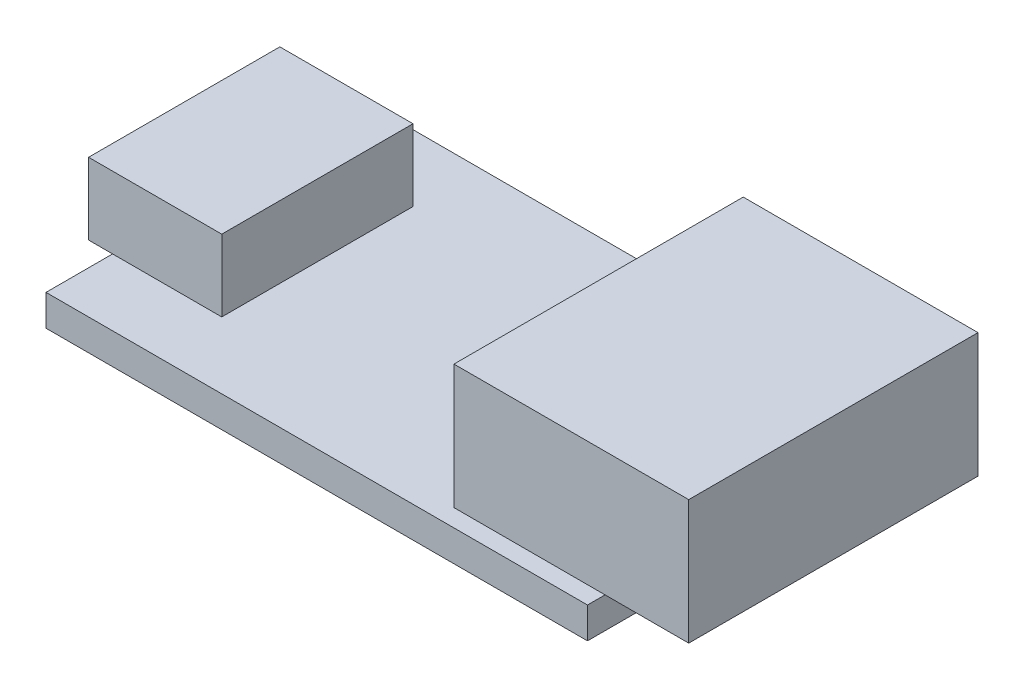
ISO-10303-21;
HEADER;
FILE_DESCRIPTION(('STEP AP214'),'2;1');
FILE_NAME('part.step','',(''),(''),'','','');
FILE_SCHEMA(('AUTOMOTIVE_DESIGN { 1 0 10303 214 1 1 1 1 }'));
ENDSEC;
DATA;
#1=APPLICATION_CONTEXT('core data for automotive mechanical design processes');
#2=APPLICATION_PROTOCOL_DEFINITION('international standard','automotive_design',2000,#1);
#3=PRODUCT_CONTEXT('',#1,'mechanical');
#4=PRODUCT('Part','Part','',(#3));
#5=PRODUCT_RELATED_PRODUCT_CATEGORY('part','',(#4));
#6=PRODUCT_DEFINITION_FORMATION('','',#4);
#7=PRODUCT_DEFINITION_CONTEXT('part definition',#1,'design');
#8=PRODUCT_DEFINITION('design','',#6,#7);
#9=PRODUCT_DEFINITION_SHAPE('','',#8);
#10=(LENGTH_UNIT() NAMED_UNIT(*) SI_UNIT(.MILLI.,.METRE.));
#11=(NAMED_UNIT(*) PLANE_ANGLE_UNIT() SI_UNIT($,.RADIAN.));
#12=(NAMED_UNIT(*) SI_UNIT($,.STERADIAN.) SOLID_ANGLE_UNIT());
#13=UNCERTAINTY_MEASURE_WITH_UNIT(LENGTH_MEASURE(1.E-05),#10,'distance_accuracy_value','');
#14=(GEOMETRIC_REPRESENTATION_CONTEXT(3) GLOBAL_UNCERTAINTY_ASSIGNED_CONTEXT((#13)) GLOBAL_UNIT_ASSIGNED_CONTEXT((#10,
#11,#12)) REPRESENTATION_CONTEXT('',''));
#15=CARTESIAN_POINT('',(0.,0.,0.));
#16=DIRECTION('',(0.,0.,1.));
#17=DIRECTION('',(1.,0.,0.));
#18=AXIS2_PLACEMENT_3D('',#15,#16,#17);
#19=CARTESIAN_POINT('',(-1.0034098301378,3.,-4.));
#20=DIRECTION('',(1.,0.,0.));
#21=DIRECTION('',(0.,0.,-1.));
#22=AXIS2_PLACEMENT_3D('',#19,#20,#21);
#23=PLANE('',#22);
#24=DIRECTION('',(0.,0.,1.));
#25=VECTOR('',#24,1.);
#26=CARTESIAN_POINT('',(-1.0034098301378,0.,-4.));
#27=LINE('',#26,#25);
#28=CARTESIAN_POINT('',(-1.0034098301378,0.,-4.));
#29=VERTEX_POINT('',#28);
#30=CARTESIAN_POINT('',(-1.0034098301378,0.,4.));
#31=VERTEX_POINT('',#30);
#32=EDGE_CURVE('E109',#29,#31,#27,.T.);
#33=ORIENTED_EDGE('',*,*,#32,.T.);
#34=DIRECTION('',(0.,-1.,0.));
#35=VECTOR('',#34,1.);
#36=CARTESIAN_POINT('',(-1.0034098301378,3.,4.));
#37=LINE('',#36,#35);
#38=CARTESIAN_POINT('',(-1.0034098301378,3.,4.));
#39=VERTEX_POINT('',#38);
#40=EDGE_CURVE('E12',#39,#31,#37,.T.);
#41=ORIENTED_EDGE('',*,*,#40,.F.);
#42=DIRECTION('',(0.,0.,1.));
#43=VECTOR('',#42,1.);
#44=CARTESIAN_POINT('',(-1.0034098301378,3.,-4.));
#45=LINE('',#44,#43);
#46=CARTESIAN_POINT('',(-1.0034098301378,3.,-4.));
#47=VERTEX_POINT('',#46);
#48=EDGE_CURVE('E95',#47,#39,#45,.T.);
#49=ORIENTED_EDGE('',*,*,#48,.F.);
#50=DIRECTION('',(0.,-1.,0.));
#51=VECTOR('',#50,1.);
#52=CARTESIAN_POINT('',(-1.0034098301378,3.,-4.));
#53=LINE('',#52,#51);
#54=EDGE_CURVE('E62',#47,#29,#53,.T.);
#55=ORIENTED_EDGE('',*,*,#54,.T.);
#56=EDGE_LOOP('',(#33,#41,#49,#55));
#57=FACE_BOUND('',#56,.T.);
#58=ADVANCED_FACE('F46',(#57),#23,.F.);
#59=CARTESIAN_POINT('',(-1.0034098301378,3.,4.));
#60=DIRECTION('',(0.,0.,-1.));
#61=DIRECTION('',(-1.,0.,0.));
#62=AXIS2_PLACEMENT_3D('',#59,#60,#61);
#63=PLANE('',#62);
#64=DIRECTION('',(1.,0.,0.));
#65=VECTOR('',#64,1.);
#66=CARTESIAN_POINT('',(-1.0034098301378,0.,4.));
#67=LINE('',#66,#65);
#68=CARTESIAN_POINT('',(4.5665901698622,0.,4.));
#69=VERTEX_POINT('',#68);
#70=EDGE_CURVE('E100',#31,#69,#67,.T.);
#71=ORIENTED_EDGE('',*,*,#70,.T.);
#72=DIRECTION('',(0.,-1.,0.));
#73=VECTOR('',#72,1.);
#74=CARTESIAN_POINT('',(4.5665901698622,3.,4.));
#75=LINE('',#74,#73);
#76=CARTESIAN_POINT('',(4.5665901698622,3.,4.));
#77=VERTEX_POINT('',#76);
#78=EDGE_CURVE('E54',#77,#69,#75,.T.);
#79=ORIENTED_EDGE('',*,*,#78,.F.);
#80=DIRECTION('',(1.,0.,0.));
#81=VECTOR('',#80,1.);
#82=CARTESIAN_POINT('',(-1.0034098301378,3.,4.));
#83=LINE('',#82,#81);
#84=EDGE_CURVE('E87',#39,#77,#83,.T.);
#85=ORIENTED_EDGE('',*,*,#84,.F.);
#86=ORIENTED_EDGE('',*,*,#40,.T.);
#87=EDGE_LOOP('',(#71,#79,#85,#86));
#88=FACE_BOUND('',#87,.T.);
#89=ADVANCED_FACE('F99',(#88),#63,.F.);
#90=CARTESIAN_POINT('',(4.5665901698622,3.,-4.));
#91=DIRECTION('',(1.,0.,0.));
#92=DIRECTION('',(0.,0.,-1.));
#93=AXIS2_PLACEMENT_3D('',#90,#91,#92);
#94=PLANE('',#93);
#95=DIRECTION('',(0.,0.,1.));
#96=VECTOR('',#95,1.);
#97=CARTESIAN_POINT('',(4.5665901698622,0.,-4.));
#98=LINE('',#97,#96);
#99=CARTESIAN_POINT('',(4.5665901698622,0.,-4.));
#100=VERTEX_POINT('',#99);
#101=EDGE_CURVE('E112',#100,#69,#98,.T.);
#102=ORIENTED_EDGE('',*,*,#101,.F.);
#103=DIRECTION('',(0.,-1.,0.));
#104=VECTOR('',#103,1.);
#105=CARTESIAN_POINT('',(4.5665901698622,3.,-4.));
#106=LINE('',#105,#104);
#107=CARTESIAN_POINT('',(4.5665901698622,3.,-4.));
#108=VERTEX_POINT('',#107);
#109=EDGE_CURVE('E76',#108,#100,#106,.T.);
#110=ORIENTED_EDGE('',*,*,#109,.F.);
#111=DIRECTION('',(0.,0.,1.));
#112=VECTOR('',#111,1.);
#113=CARTESIAN_POINT('',(4.5665901698622,3.,-4.));
#114=LINE('',#113,#112);
#115=EDGE_CURVE('E94',#108,#77,#114,.T.);
#116=ORIENTED_EDGE('',*,*,#115,.T.);
#117=ORIENTED_EDGE('',*,*,#78,.T.);
#118=EDGE_LOOP('',(#102,#110,#116,#117));
#119=FACE_BOUND('',#118,.T.);
#120=ADVANCED_FACE('F103',(#119),#94,.T.);
#121=CARTESIAN_POINT('',(-1.0034098301378,3.,-4.));
#122=DIRECTION('',(0.,0.,-1.));
#123=DIRECTION('',(-1.,0.,0.));
#124=AXIS2_PLACEMENT_3D('',#121,#122,#123);
#125=PLANE('',#124);
#126=DIRECTION('',(1.,0.,0.));
#127=VECTOR('',#126,1.);
#128=CARTESIAN_POINT('',(-1.0034098301378,0.,-4.));
#129=LINE('',#128,#127);
#130=EDGE_CURVE('E114',#29,#100,#129,.T.);
#131=ORIENTED_EDGE('',*,*,#130,.F.);
#132=ORIENTED_EDGE('',*,*,#54,.F.);
#133=DIRECTION('',(1.,0.,0.));
#134=VECTOR('',#133,1.);
#135=CARTESIAN_POINT('',(-1.0034098301378,3.,-4.));
#136=LINE('',#135,#134);
#137=EDGE_CURVE('E104',#47,#108,#136,.T.);
#138=ORIENTED_EDGE('',*,*,#137,.T.);
#139=ORIENTED_EDGE('',*,*,#109,.T.);
#140=EDGE_LOOP('',(#131,#132,#138,#139));
#141=FACE_BOUND('',#140,.T.);
#142=ADVANCED_FACE('F120',(#141),#125,.T.);
#143=CARTESIAN_POINT('',(0.,3.,0.));
#144=DIRECTION('',(0.,1.,0.));
#145=DIRECTION('',(0.,0.,1.));
#146=AXIS2_PLACEMENT_3D('',#143,#144,#145);
#147=PLANE('',#146);
#148=ORIENTED_EDGE('',*,*,#48,.T.);
#149=ORIENTED_EDGE('',*,*,#84,.T.);
#150=ORIENTED_EDGE('',*,*,#115,.F.);
#151=ORIENTED_EDGE('',*,*,#137,.F.);
#152=EDGE_LOOP('',(#148,#149,#150,#151));
#153=FACE_BOUND('',#152,.T.);
#154=ADVANCED_FACE('F91',(#153),#147,.T.);
#155=CARTESIAN_POINT('',(0.,0.,0.));
#156=DIRECTION('',(0.,1.,0.));
#157=DIRECTION('',(0.,0.,1.));
#158=AXIS2_PLACEMENT_3D('',#155,#156,#157);
#159=PLANE('',#158);
#160=ORIENTED_EDGE('',*,*,#32,.F.);
#161=ORIENTED_EDGE('',*,*,#130,.T.);
#162=ORIENTED_EDGE('',*,*,#101,.T.);
#163=ORIENTED_EDGE('',*,*,#70,.F.);
#164=EDGE_LOOP('',(#160,#161,#162,#163));
#165=FACE_BOUND('',#164,.T.);
#166=ADVANCED_FACE('F119',(#165),#159,.F.);
#167=CLOSED_SHELL('',(#58,#89,#120,#142,#154,#166));
#168=MANIFOLD_SOLID_BREP('B2',#167);
#169=CARTESIAN_POINT('',(26.15,5.2,-6.05));
#170=DIRECTION('',(0.,0.,1.));
#171=DIRECTION('',(1.,0.,0.));
#172=AXIS2_PLACEMENT_3D('',#169,#170,#171);
#173=PLANE('',#172);
#174=DIRECTION('',(-1.,0.,0.));
#175=VECTOR('',#174,1.);
#176=CARTESIAN_POINT('',(26.15,0.,-6.05));
#177=LINE('',#176,#175);
#178=CARTESIAN_POINT('',(26.15,0.,-6.05));
#179=VERTEX_POINT('',#178);
#180=CARTESIAN_POINT('',(16.33,0.,-6.05));
#181=VERTEX_POINT('',#180);
#182=EDGE_CURVE('E242',#179,#181,#177,.T.);
#183=ORIENTED_EDGE('',*,*,#182,.T.);
#184=DIRECTION('',(0.,-1.,0.));
#185=VECTOR('',#184,1.);
#186=CARTESIAN_POINT('',(16.33,5.2,-6.05));
#187=LINE('',#186,#185);
#188=CARTESIAN_POINT('',(16.33,5.2,-6.05));
#189=VERTEX_POINT('',#188);
#190=EDGE_CURVE('E44',#189,#181,#187,.T.);
#191=ORIENTED_EDGE('',*,*,#190,.F.);
#192=DIRECTION('',(-1.,0.,0.));
#193=VECTOR('',#192,1.);
#194=CARTESIAN_POINT('',(26.15,5.2,-6.05));
#195=LINE('',#194,#193);
#196=CARTESIAN_POINT('',(26.15,5.2,-6.05));
#197=VERTEX_POINT('',#196);
#198=EDGE_CURVE('E228',#197,#189,#195,.T.);
#199=ORIENTED_EDGE('',*,*,#198,.F.);
#200=DIRECTION('',(0.,-1.,0.));
#201=VECTOR('',#200,1.);
#202=CARTESIAN_POINT('',(26.15,5.2,-6.05));
#203=LINE('',#202,#201);
#204=EDGE_CURVE('E195',#197,#179,#203,.T.);
#205=ORIENTED_EDGE('',*,*,#204,.T.);
#206=EDGE_LOOP('',(#183,#191,#199,#205));
#207=FACE_BOUND('',#206,.T.);
#208=ADVANCED_FACE('F179',(#207),#173,.F.);
#209=CARTESIAN_POINT('',(16.33,5.2,-6.05));
#210=DIRECTION('',(1.,0.,0.));
#211=DIRECTION('',(0.,0.,-1.));
#212=AXIS2_PLACEMENT_3D('',#209,#210,#211);
#213=PLANE('',#212);
#214=DIRECTION('',(0.,0.,1.));
#215=VECTOR('',#214,1.);
#216=CARTESIAN_POINT('',(16.33,0.,-6.05));
#217=LINE('',#216,#215);
#218=CARTESIAN_POINT('',(16.33,0.,6.05));
#219=VERTEX_POINT('',#218);
#220=EDGE_CURVE('E233',#181,#219,#217,.T.);
#221=ORIENTED_EDGE('',*,*,#220,.T.);
#222=DIRECTION('',(0.,-1.,0.));
#223=VECTOR('',#222,1.);
#224=CARTESIAN_POINT('',(16.33,5.2,6.05));
#225=LINE('',#224,#223);
#226=CARTESIAN_POINT('',(16.33,5.2,6.05));
#227=VERTEX_POINT('',#226);
#228=EDGE_CURVE('E187',#227,#219,#225,.T.);
#229=ORIENTED_EDGE('',*,*,#228,.F.);
#230=DIRECTION('',(0.,0.,1.));
#231=VECTOR('',#230,1.);
#232=CARTESIAN_POINT('',(16.33,5.2,-6.05));
#233=LINE('',#232,#231);
#234=EDGE_CURVE('E220',#189,#227,#233,.T.);
#235=ORIENTED_EDGE('',*,*,#234,.F.);
#236=ORIENTED_EDGE('',*,*,#190,.T.);
#237=EDGE_LOOP('',(#221,#229,#235,#236));
#238=FACE_BOUND('',#237,.T.);
#239=ADVANCED_FACE('F232',(#238),#213,.F.);
#240=CARTESIAN_POINT('',(26.15,5.2,6.05));
#241=DIRECTION('',(0.,0.,1.));
#242=DIRECTION('',(1.,0.,0.));
#243=AXIS2_PLACEMENT_3D('',#240,#241,#242);
#244=PLANE('',#243);
#245=DIRECTION('',(-1.,0.,0.));
#246=VECTOR('',#245,1.);
#247=CARTESIAN_POINT('',(26.15,0.,6.05));
#248=LINE('',#247,#246);
#249=CARTESIAN_POINT('',(26.15,0.,6.05));
#250=VERTEX_POINT('',#249);
#251=EDGE_CURVE('E245',#250,#219,#248,.T.);
#252=ORIENTED_EDGE('',*,*,#251,.F.);
#253=DIRECTION('',(0.,-1.,0.));
#254=VECTOR('',#253,1.);
#255=CARTESIAN_POINT('',(26.15,5.2,6.05));
#256=LINE('',#255,#254);
#257=CARTESIAN_POINT('',(26.15,5.2,6.05));
#258=VERTEX_POINT('',#257);
#259=EDGE_CURVE('E209',#258,#250,#256,.T.);
#260=ORIENTED_EDGE('',*,*,#259,.F.);
#261=DIRECTION('',(-1.,0.,0.));
#262=VECTOR('',#261,1.);
#263=CARTESIAN_POINT('',(26.15,5.2,6.05));
#264=LINE('',#263,#262);
#265=EDGE_CURVE('E227',#258,#227,#264,.T.);
#266=ORIENTED_EDGE('',*,*,#265,.T.);
#267=ORIENTED_EDGE('',*,*,#228,.T.);
#268=EDGE_LOOP('',(#252,#260,#266,#267));
#269=FACE_BOUND('',#268,.T.);
#270=ADVANCED_FACE('F236',(#269),#244,.T.);
#271=CARTESIAN_POINT('',(26.15,5.2,-6.05));
#272=DIRECTION('',(1.,0.,0.));
#273=DIRECTION('',(0.,0.,-1.));
#274=AXIS2_PLACEMENT_3D('',#271,#272,#273);
#275=PLANE('',#274);
#276=DIRECTION('',(0.,0.,1.));
#277=VECTOR('',#276,1.);
#278=CARTESIAN_POINT('',(26.15,0.,-6.05));
#279=LINE('',#278,#277);
#280=EDGE_CURVE('E247',#179,#250,#279,.T.);
#281=ORIENTED_EDGE('',*,*,#280,.F.);
#282=ORIENTED_EDGE('',*,*,#204,.F.);
#283=DIRECTION('',(0.,0.,1.));
#284=VECTOR('',#283,1.);
#285=CARTESIAN_POINT('',(26.15,5.2,-6.05));
#286=LINE('',#285,#284);
#287=EDGE_CURVE('E237',#197,#258,#286,.T.);
#288=ORIENTED_EDGE('',*,*,#287,.T.);
#289=ORIENTED_EDGE('',*,*,#259,.T.);
#290=EDGE_LOOP('',(#281,#282,#288,#289));
#291=FACE_BOUND('',#290,.T.);
#292=ADVANCED_FACE('F253',(#291),#275,.T.);
#293=CARTESIAN_POINT('',(0.,5.2,0.));
#294=DIRECTION('',(0.,1.,0.));
#295=DIRECTION('',(0.,0.,1.));
#296=AXIS2_PLACEMENT_3D('',#293,#294,#295);
#297=PLANE('',#296);
#298=ORIENTED_EDGE('',*,*,#198,.T.);
#299=ORIENTED_EDGE('',*,*,#234,.T.);
#300=ORIENTED_EDGE('',*,*,#265,.F.);
#301=ORIENTED_EDGE('',*,*,#287,.F.);
#302=EDGE_LOOP('',(#298,#299,#300,#301));
#303=FACE_BOUND('',#302,.T.);
#304=ADVANCED_FACE('F224',(#303),#297,.T.);
#305=CARTESIAN_POINT('',(0.,0.,0.));
#306=DIRECTION('',(0.,1.,0.));
#307=DIRECTION('',(0.,0.,1.));
#308=AXIS2_PLACEMENT_3D('',#305,#306,#307);
#309=PLANE('',#308);
#310=ORIENTED_EDGE('',*,*,#182,.F.);
#311=ORIENTED_EDGE('',*,*,#280,.T.);
#312=ORIENTED_EDGE('',*,*,#251,.T.);
#313=ORIENTED_EDGE('',*,*,#220,.F.);
#314=EDGE_LOOP('',(#310,#311,#312,#313));
#315=FACE_BOUND('',#314,.T.);
#316=ADVANCED_FACE('F252',(#315),#309,.F.);
#317=CLOSED_SHELL('',(#208,#239,#270,#292,#304,#316));
#318=MANIFOLD_SOLID_BREP('B6',#317);
#319=CARTESIAN_POINT('',(0.,-1.3,-6.785));
#320=DIRECTION('',(-1.,0.,0.));
#321=DIRECTION('',(0.,0.,1.));
#322=AXIS2_PLACEMENT_3D('',#319,#320,#321);
#323=PLANE('',#322);
#324=DIRECTION('',(0.,0.,1.));
#325=VECTOR('',#324,1.);
#326=CARTESIAN_POINT('',(0.,0.,-6.785));
#327=LINE('',#326,#325);
#328=CARTESIAN_POINT('',(0.,0.,-6.785));
#329=VERTEX_POINT('',#328);
#330=CARTESIAN_POINT('',(0.,0.,6.78500000000001));
#331=VERTEX_POINT('',#330);
#332=EDGE_CURVE('E368',#329,#331,#327,.T.);
#333=ORIENTED_EDGE('',*,*,#332,.F.);
#334=DIRECTION('',(0.,1.,0.));
#335=VECTOR('',#334,1.);
#336=CARTESIAN_POINT('',(0.,-1.3,-6.785));
#337=LINE('',#336,#335);
#338=CARTESIAN_POINT('',(0.,-1.3,-6.785));
#339=VERTEX_POINT('',#338);
#340=EDGE_CURVE('E177',#339,#329,#337,.T.);
#341=ORIENTED_EDGE('',*,*,#340,.F.);
#342=DIRECTION('',(0.,0.,1.));
#343=VECTOR('',#342,1.);
#344=CARTESIAN_POINT('',(0.,-1.3,-6.785));
#345=LINE('',#344,#343);
#346=CARTESIAN_POINT('',(0.,-1.3,6.78500000000001));
#347=VERTEX_POINT('',#346);
#348=EDGE_CURVE('E363',#339,#347,#345,.T.);
#349=ORIENTED_EDGE('',*,*,#348,.T.);
#350=DIRECTION('',(0.,1.,0.));
#351=VECTOR('',#350,1.);
#352=CARTESIAN_POINT('',(0.,-1.3,6.78500000000001));
#353=LINE('',#352,#351);
#354=EDGE_CURVE('E306',#347,#331,#353,.T.);
#355=ORIENTED_EDGE('',*,*,#354,.T.);
#356=EDGE_LOOP('',(#333,#341,#349,#355));
#357=FACE_BOUND('',#356,.T.);
#358=ADVANCED_FACE('F303',(#357),#323,.T.);
#359=CARTESIAN_POINT('',(0.,-1.3,-6.785));
#360=DIRECTION('',(0.,0.,1.));
#361=DIRECTION('',(1.,0.,0.));
#362=AXIS2_PLACEMENT_3D('',#359,#360,#361);
#363=PLANE('',#362);
#364=DIRECTION('',(1.,0.,0.));
#365=VECTOR('',#364,1.);
#366=CARTESIAN_POINT('',(0.,0.,-6.785));
#367=LINE('',#366,#365);
#368=CARTESIAN_POINT('',(22.65,0.,-6.78500000000001));
#369=VERTEX_POINT('',#368);
#370=EDGE_CURVE('E336',#329,#369,#367,.T.);
#371=ORIENTED_EDGE('',*,*,#370,.T.);
#372=DIRECTION('',(0.,1.,0.));
#373=VECTOR('',#372,1.);
#374=CARTESIAN_POINT('',(22.65,-1.3,-6.78500000000001));
#375=LINE('',#374,#373);
#376=CARTESIAN_POINT('',(22.65,-1.3,-6.78500000000001));
#377=VERTEX_POINT('',#376);
#378=EDGE_CURVE('E312',#377,#369,#375,.T.);
#379=ORIENTED_EDGE('',*,*,#378,.F.);
#380=DIRECTION('',(1.,0.,0.));
#381=VECTOR('',#380,1.);
#382=CARTESIAN_POINT('',(0.,-1.3,-6.785));
#383=LINE('',#382,#381);
#384=EDGE_CURVE('E353',#339,#377,#383,.T.);
#385=ORIENTED_EDGE('',*,*,#384,.F.);
#386=ORIENTED_EDGE('',*,*,#340,.T.);
#387=EDGE_LOOP('',(#371,#379,#385,#386));
#388=FACE_BOUND('',#387,.T.);
#389=ADVANCED_FACE('F378',(#388),#363,.F.);
#390=CARTESIAN_POINT('',(22.65,-1.3,-6.78500000000001));
#391=DIRECTION('',(-1.,0.,0.));
#392=DIRECTION('',(0.,0.,1.));
#393=AXIS2_PLACEMENT_3D('',#390,#391,#392);
#394=PLANE('',#393);
#395=DIRECTION('',(0.,0.,1.));
#396=VECTOR('',#395,1.);
#397=CARTESIAN_POINT('',(22.65,0.,-6.78500000000001));
#398=LINE('',#397,#396);
#399=CARTESIAN_POINT('',(22.65,0.,6.78499999999999));
#400=VERTEX_POINT('',#399);
#401=EDGE_CURVE('E360',#369,#400,#398,.T.);
#402=ORIENTED_EDGE('',*,*,#401,.T.);
#403=DIRECTION('',(0.,1.,0.));
#404=VECTOR('',#403,1.);
#405=CARTESIAN_POINT('',(22.65,-1.3,6.78499999999999));
#406=LINE('',#405,#404);
#407=CARTESIAN_POINT('',(22.65,-1.3,6.78499999999999));
#408=VERTEX_POINT('',#407);
#409=EDGE_CURVE('E357',#408,#400,#406,.T.);
#410=ORIENTED_EDGE('',*,*,#409,.F.);
#411=DIRECTION('',(0.,0.,1.));
#412=VECTOR('',#411,1.);
#413=CARTESIAN_POINT('',(22.65,-1.3,-6.78500000000001));
#414=LINE('',#413,#412);
#415=EDGE_CURVE('E348',#377,#408,#414,.T.);
#416=ORIENTED_EDGE('',*,*,#415,.F.);
#417=ORIENTED_EDGE('',*,*,#378,.T.);
#418=EDGE_LOOP('',(#402,#410,#416,#417));
#419=FACE_BOUND('',#418,.T.);
#420=ADVANCED_FACE('F358',(#419),#394,.F.);
#421=CARTESIAN_POINT('',(0.,-1.3,6.78500000000001));
#422=DIRECTION('',(0.,0.,1.));
#423=DIRECTION('',(1.,0.,0.));
#424=AXIS2_PLACEMENT_3D('',#421,#422,#423);
#425=PLANE('',#424);
#426=DIRECTION('',(1.,0.,0.));
#427=VECTOR('',#426,1.);
#428=CARTESIAN_POINT('',(0.,0.,6.78500000000001));
#429=LINE('',#428,#427);
#430=EDGE_CURVE('E371',#331,#400,#429,.T.);
#431=ORIENTED_EDGE('',*,*,#430,.F.);
#432=ORIENTED_EDGE('',*,*,#354,.F.);
#433=DIRECTION('',(1.,0.,0.));
#434=VECTOR('',#433,1.);
#435=CARTESIAN_POINT('',(0.,-1.3,6.78500000000001));
#436=LINE('',#435,#434);
#437=EDGE_CURVE('E352',#347,#408,#436,.T.);
#438=ORIENTED_EDGE('',*,*,#437,.T.);
#439=ORIENTED_EDGE('',*,*,#409,.T.);
#440=EDGE_LOOP('',(#431,#432,#438,#439));
#441=FACE_BOUND('',#440,.T.);
#442=ADVANCED_FACE('F362',(#441),#425,.T.);
#443=CARTESIAN_POINT('',(0.,-1.3,0.));
#444=DIRECTION('',(0.,1.,0.));
#445=DIRECTION('',(0.,0.,1.));
#446=AXIS2_PLACEMENT_3D('',#443,#444,#445);
#447=PLANE('',#446);
#448=ORIENTED_EDGE('',*,*,#348,.F.);
#449=ORIENTED_EDGE('',*,*,#384,.T.);
#450=ORIENTED_EDGE('',*,*,#415,.T.);
#451=ORIENTED_EDGE('',*,*,#437,.F.);
#452=EDGE_LOOP('',(#448,#449,#450,#451));
#453=FACE_BOUND('',#452,.T.);
#454=ADVANCED_FACE('F351',(#453),#447,.F.);
#455=CARTESIAN_POINT('',(0.,0.,0.));
#456=DIRECTION('',(0.,1.,0.));
#457=DIRECTION('',(0.,0.,1.));
#458=AXIS2_PLACEMENT_3D('',#455,#456,#457);
#459=PLANE('',#458);
#460=ORIENTED_EDGE('',*,*,#332,.T.);
#461=ORIENTED_EDGE('',*,*,#430,.T.);
#462=ORIENTED_EDGE('',*,*,#401,.F.);
#463=ORIENTED_EDGE('',*,*,#370,.F.);
#464=EDGE_LOOP('',(#460,#461,#462,#463));
#465=FACE_BOUND('',#464,.T.);
#466=ADVANCED_FACE('F376',(#465),#459,.T.);
#467=CLOSED_SHELL('',(#358,#389,#420,#442,#454,#466));
#468=MANIFOLD_SOLID_BREP('B38',#467);
#469=ADVANCED_BREP_SHAPE_REPRESENTATION('',(#18,#168,#318,#468),#14);
#470=SHAPE_DEFINITION_REPRESENTATION(#9,#469);
ENDSEC;
END-ISO-10303-21;
